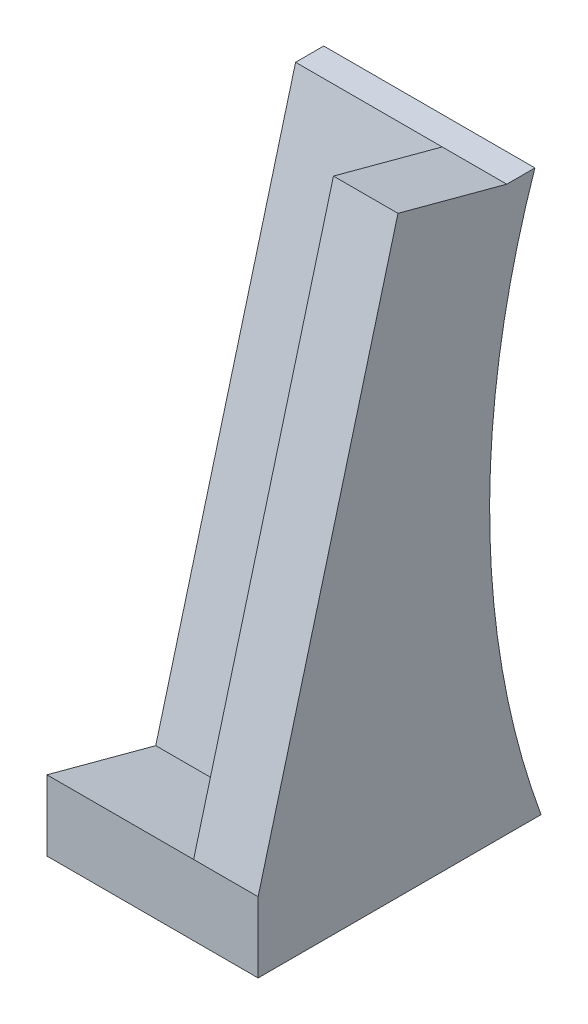
ISO-10303-21;
HEADER;
FILE_DESCRIPTION(('STEP AP214'),'2;1');
FILE_NAME('part.step','',(''),(''),'','','');
FILE_SCHEMA(('AUTOMOTIVE_DESIGN { 1 0 10303 214 1 1 1 1 }'));
ENDSEC;
DATA;
#1=APPLICATION_CONTEXT('core data for automotive mechanical design processes');
#2=APPLICATION_PROTOCOL_DEFINITION('international standard','automotive_design',2000,#1);
#3=PRODUCT_CONTEXT('',#1,'mechanical');
#4=PRODUCT('Part','Part','',(#3));
#5=PRODUCT_RELATED_PRODUCT_CATEGORY('part','',(#4));
#6=PRODUCT_DEFINITION_FORMATION('','',#4);
#7=PRODUCT_DEFINITION_CONTEXT('part definition',#1,'design');
#8=PRODUCT_DEFINITION('design','',#6,#7);
#9=PRODUCT_DEFINITION_SHAPE('','',#8);
#10=(LENGTH_UNIT() NAMED_UNIT(*) SI_UNIT(.MILLI.,.METRE.));
#11=(NAMED_UNIT(*) PLANE_ANGLE_UNIT() SI_UNIT($,.RADIAN.));
#12=(NAMED_UNIT(*) SI_UNIT($,.STERADIAN.) SOLID_ANGLE_UNIT());
#13=UNCERTAINTY_MEASURE_WITH_UNIT(LENGTH_MEASURE(1.E-05),#10,'distance_accuracy_value','');
#14=(GEOMETRIC_REPRESENTATION_CONTEXT(3) GLOBAL_UNCERTAINTY_ASSIGNED_CONTEXT((#13)) GLOBAL_UNIT_ASSIGNED_CONTEXT((#10,
#11,#12)) REPRESENTATION_CONTEXT('',''));
#15=CARTESIAN_POINT('',(0.,0.,0.));
#16=DIRECTION('',(0.,0.,1.));
#17=DIRECTION('',(1.,0.,0.));
#18=AXIS2_PLACEMENT_3D('',#15,#16,#17);
#19=CARTESIAN_POINT('',(38.1,7.44079700351684,-19.6276127901939));
#20=DIRECTION('',(0.,-0.258819045102514,-0.96592582628907));
#21=DIRECTION('',(0.,0.96592582628907,-0.258819045102514));
#22=AXIS2_PLACEMENT_3D('',#19,#20,#21);
#23=PLANE('',#22);
#24=DIRECTION('',(0.,-0.96592582628907,0.258819045102514));
#25=VECTOR('',#24,1.);
#26=CARTESIAN_POINT('',(26.4595011753954,101.6,-44.857495193059));
#27=LINE('',#26,#25);
#28=CARTESIAN_POINT('',(26.4595011753954,101.6,-44.857495193059));
#29=VERTEX_POINT('',#28);
#30=CARTESIAN_POINT('',(26.4595011753954,7.44079700351687,-19.6276127901939));
#31=VERTEX_POINT('',#30);
#32=EDGE_CURVE('E119',#29,#31,#27,.T.);
#33=ORIENTED_EDGE('',*,*,#32,.F.);
#34=DIRECTION('',(-1.,0.,0.));
#35=VECTOR('',#34,1.);
#36=CARTESIAN_POINT('',(38.1,101.6,-44.857495193059));
#37=LINE('',#36,#35);
#38=CARTESIAN_POINT('',(0.,101.6,-44.857495193059));
#39=VERTEX_POINT('',#38);
#40=EDGE_CURVE('E136',#29,#39,#37,.T.);
#41=ORIENTED_EDGE('',*,*,#40,.T.);
#42=DIRECTION('',(0.,-0.96592582628907,0.258819045102514));
#43=VECTOR('',#42,1.);
#44=CARTESIAN_POINT('',(0.,7.44079700351684,-19.6276127901939));
#45=LINE('',#44,#43);
#46=CARTESIAN_POINT('',(0.,7.44079700351684,-19.6276127901939));
#47=VERTEX_POINT('',#46);
#48=EDGE_CURVE('E158',#39,#47,#45,.T.);
#49=ORIENTED_EDGE('',*,*,#48,.T.);
#50=DIRECTION('',(-1.,0.,0.));
#51=VECTOR('',#50,1.);
#52=CARTESIAN_POINT('',(38.1,7.44079700351684,-19.6276127901939));
#53=LINE('',#52,#51);
#54=EDGE_CURVE('E73',#31,#47,#53,.T.);
#55=ORIENTED_EDGE('',*,*,#54,.F.);
#56=EDGE_LOOP('',(#33,#41,#49,#55));
#57=FACE_BOUND('',#56,.T.);
#58=ADVANCED_FACE('F32',(#57),#23,.F.);
#59=CARTESIAN_POINT('',(38.1,12.7,0.));
#60=DIRECTION('',(0.,-0.965925826289069,0.258819045102518));
#61=DIRECTION('',(0.,-0.258819045102518,-0.965925826289069));
#62=AXIS2_PLACEMENT_3D('',#59,#60,#61);
#63=PLANE('',#62);
#64=DIRECTION('',(0.,-0.258819045102514,-0.96592582628907));
#65=VECTOR('',#64,1.);
#66=CARTESIAN_POINT('',(26.4595011753954,12.7,0.));
#67=LINE('',#66,#65);
#68=CARTESIAN_POINT('',(26.4595011753954,12.7,0.));
#69=VERTEX_POINT('',#68);
#70=EDGE_CURVE('E121',#69,#31,#67,.T.);
#71=ORIENTED_EDGE('',*,*,#70,.T.);
#72=ORIENTED_EDGE('',*,*,#54,.T.);
#73=DIRECTION('',(0.,0.258819045102518,0.965925826289069));
#74=VECTOR('',#73,1.);
#75=CARTESIAN_POINT('',(0.,12.7,0.));
#76=LINE('',#75,#74);
#77=CARTESIAN_POINT('',(0.,12.7,0.));
#78=VERTEX_POINT('',#77);
#79=EDGE_CURVE('E129',#47,#78,#76,.T.);
#80=ORIENTED_EDGE('',*,*,#79,.T.);
#81=DIRECTION('',(-1.,0.,0.));
#82=VECTOR('',#81,1.);
#83=CARTESIAN_POINT('',(38.1,12.7,0.));
#84=LINE('',#83,#82);
#85=EDGE_CURVE('E80',#69,#78,#84,.T.);
#86=ORIENTED_EDGE('',*,*,#85,.F.);
#87=EDGE_LOOP('',(#71,#72,#80,#86));
#88=FACE_BOUND('',#87,.T.);
#89=ADVANCED_FACE('F127',(#88),#63,.F.);
#90=CARTESIAN_POINT('',(38.1,12.7,0.));
#91=DIRECTION('',(0.,0.,-1.));
#92=DIRECTION('',(0.,1.,0.));
#93=AXIS2_PLACEMENT_3D('',#90,#91,#92);
#94=PLANE('',#93);
#95=DIRECTION('',(0.,-1.,0.));
#96=VECTOR('',#95,1.);
#97=CARTESIAN_POINT('',(0.,12.7,0.));
#98=LINE('',#97,#96);
#99=CARTESIAN_POINT('',(0.,0.,0.));
#100=VERTEX_POINT('',#99);
#101=EDGE_CURVE('E124',#78,#100,#98,.T.);
#102=ORIENTED_EDGE('',*,*,#101,.T.);
#103=DIRECTION('',(-1.,0.,0.));
#104=VECTOR('',#103,1.);
#105=CARTESIAN_POINT('',(38.1,0.,0.));
#106=LINE('',#105,#104);
#107=CARTESIAN_POINT('',(38.1,0.,0.));
#108=VERTEX_POINT('',#107);
#109=EDGE_CURVE('E11',#108,#100,#106,.T.);
#110=ORIENTED_EDGE('',*,*,#109,.F.);
#111=DIRECTION('',(0.,-1.,0.));
#112=VECTOR('',#111,1.);
#113=CARTESIAN_POINT('',(38.1,12.7,0.));
#114=LINE('',#113,#112);
#115=CARTESIAN_POINT('',(38.1,12.7,0.));
#116=VERTEX_POINT('',#115);
#117=EDGE_CURVE('E135',#116,#108,#114,.T.);
#118=ORIENTED_EDGE('',*,*,#117,.F.);
#119=EDGE_CURVE('E111',#116,#69,#84,.T.);
#120=ORIENTED_EDGE('',*,*,#119,.T.);
#121=ORIENTED_EDGE('',*,*,#85,.T.);
#122=EDGE_LOOP('',(#102,#110,#118,#120,#121));
#123=FACE_BOUND('',#122,.T.);
#124=ADVANCED_FACE('F34',(#123),#94,.F.);
#125=CARTESIAN_POINT('',(38.1,0.,0.));
#126=DIRECTION('',(0.,1.,0.));
#127=DIRECTION('',(0.,0.,1.));
#128=AXIS2_PLACEMENT_3D('',#125,#126,#127);
#129=PLANE('',#128);
#130=DIRECTION('',(0.,0.,-1.));
#131=VECTOR('',#130,1.);
#132=CARTESIAN_POINT('',(0.,0.,0.));
#133=LINE('',#132,#131);
#134=CARTESIAN_POINT('',(0.,0.,-51.0442339810043));
#135=VERTEX_POINT('',#134);
#136=EDGE_CURVE('E153',#100,#135,#133,.T.);
#137=ORIENTED_EDGE('',*,*,#136,.T.);
#138=DIRECTION('',(-1.,0.,0.));
#139=VECTOR('',#138,1.);
#140=CARTESIAN_POINT('',(38.1,0.,-51.0442339810043));
#141=LINE('',#140,#139);
#142=CARTESIAN_POINT('',(38.1,0.,-51.0442339810043));
#143=VERTEX_POINT('',#142);
#144=EDGE_CURVE('E41',#143,#135,#141,.T.);
#145=ORIENTED_EDGE('',*,*,#144,.F.);
#146=DIRECTION('',(0.,0.,-1.));
#147=VECTOR('',#146,1.);
#148=CARTESIAN_POINT('',(38.1,0.,0.));
#149=LINE('',#148,#147);
#150=EDGE_CURVE('E84',#108,#143,#149,.T.);
#151=ORIENTED_EDGE('',*,*,#150,.F.);
#152=ORIENTED_EDGE('',*,*,#109,.T.);
#153=EDGE_LOOP('',(#137,#145,#151,#152));
#154=FACE_BOUND('',#153,.T.);
#155=ADVANCED_FACE('F168',(#154),#129,.F.);
#156=CARTESIAN_POINT('',(38.1,52.3650605442912,-194.165373000342));
#157=DIRECTION('',(-1.,0.,0.));
#158=DIRECTION('',(0.,0.,1.));
#159=AXIS2_PLACEMENT_3D('',#156,#157,#158);
#160=CYLINDRICAL_SURFACE('',#159,152.4);
#161=CARTESIAN_POINT('',(0.,52.3650605442912,-194.165373000342));
#162=DIRECTION('',(-1.,0.,0.));
#163=DIRECTION('',(0.,0.,-1.));
#164=AXIS2_PLACEMENT_3D('',#161,#162,#163);
#165=CIRCLE('',#164,152.4);
#166=CARTESIAN_POINT('',(0.,101.6,-49.937495193059));
#167=VERTEX_POINT('',#166);
#168=EDGE_CURVE('E149',#135,#167,#165,.T.);
#169=ORIENTED_EDGE('',*,*,#168,.T.);
#170=DIRECTION('',(-1.,0.,0.));
#171=VECTOR('',#170,1.);
#172=CARTESIAN_POINT('',(38.1,101.6,-49.937495193059));
#173=LINE('',#172,#171);
#174=CARTESIAN_POINT('',(38.1,101.6,-49.937495193059));
#175=VERTEX_POINT('',#174);
#176=EDGE_CURVE('E143',#175,#167,#173,.T.);
#177=ORIENTED_EDGE('',*,*,#176,.F.);
#178=CARTESIAN_POINT('',(38.1,52.3650605442912,-194.165373000342));
#179=DIRECTION('',(-1.,0.,0.));
#180=DIRECTION('',(0.,0.,-1.));
#181=AXIS2_PLACEMENT_3D('',#178,#179,#180);
#182=CIRCLE('',#181,152.4);
#183=EDGE_CURVE('E49',#143,#175,#182,.T.);
#184=ORIENTED_EDGE('',*,*,#183,.F.);
#185=ORIENTED_EDGE('',*,*,#144,.T.);
#186=EDGE_LOOP('',(#169,#177,#184,#185));
#187=FACE_BOUND('',#186,.T.);
#188=ADVANCED_FACE('F148',(#187),#160,.F.);
#189=CARTESIAN_POINT('',(38.1,101.6,-44.857495193059));
#190=DIRECTION('',(0.,-1.,0.));
#191=DIRECTION('',(0.,0.,-1.));
#192=AXIS2_PLACEMENT_3D('',#189,#190,#191);
#193=PLANE('',#192);
#194=DIRECTION('',(0.,0.,1.));
#195=VECTOR('',#194,1.);
#196=CARTESIAN_POINT('',(0.,101.6,-44.857495193059));
#197=LINE('',#196,#195);
#198=EDGE_CURVE('E156',#167,#39,#197,.T.);
#199=ORIENTED_EDGE('',*,*,#198,.T.);
#200=ORIENTED_EDGE('',*,*,#40,.F.);
#201=CARTESIAN_POINT('',(38.1,101.6,-44.857495193059));
#202=VERTEX_POINT('',#201);
#203=EDGE_CURVE('E141',#202,#29,#37,.T.);
#204=ORIENTED_EDGE('',*,*,#203,.F.);
#205=DIRECTION('',(0.,0.,1.));
#206=VECTOR('',#205,1.);
#207=CARTESIAN_POINT('',(38.1,101.6,-44.857495193059));
#208=LINE('',#207,#206);
#209=EDGE_CURVE('E131',#175,#202,#208,.T.);
#210=ORIENTED_EDGE('',*,*,#209,.F.);
#211=ORIENTED_EDGE('',*,*,#176,.T.);
#212=EDGE_LOOP('',(#199,#200,#204,#210,#211));
#213=FACE_BOUND('',#212,.T.);
#214=ADVANCED_FACE('F174',(#213),#193,.F.);
#215=CARTESIAN_POINT('',(38.1,52.3650605442912,-194.165373000342));
#216=DIRECTION('',(1.,0.,0.));
#217=DIRECTION('',(0.,0.,-1.));
#218=AXIS2_PLACEMENT_3D('',#215,#216,#217);
#219=PLANE('',#218);
#220=DIRECTION('',(0.,0.96592582628907,-0.258819045102514));
#221=VECTOR('',#220,1.);
#222=CARTESIAN_POINT('',(38.1,106.859202996483,-25.2298824028651));
#223=LINE('',#222,#221);
#224=CARTESIAN_POINT('',(38.1,106.859202996483,-25.2298824028651));
#225=VERTEX_POINT('',#224);
#226=EDGE_CURVE('E118',#116,#225,#223,.T.);
#227=ORIENTED_EDGE('',*,*,#226,.F.);
#228=ORIENTED_EDGE('',*,*,#117,.T.);
#229=ORIENTED_EDGE('',*,*,#150,.T.);
#230=ORIENTED_EDGE('',*,*,#183,.T.);
#231=ORIENTED_EDGE('',*,*,#209,.T.);
#232=DIRECTION('',(0.,-0.258819045102514,-0.96592582628907));
#233=VECTOR('',#232,1.);
#234=CARTESIAN_POINT('',(38.1,106.859202996483,-25.2298824028651));
#235=LINE('',#234,#233);
#236=EDGE_CURVE('E125',#225,#202,#235,.T.);
#237=ORIENTED_EDGE('',*,*,#236,.F.);
#238=EDGE_LOOP('',(#227,#228,#229,#230,#231,#237));
#239=FACE_BOUND('',#238,.T.);
#240=ADVANCED_FACE('F185',(#239),#219,.T.);
#241=CARTESIAN_POINT('',(0.,52.3650605442912,-194.165373000342));
#242=DIRECTION('',(1.,0.,0.));
#243=DIRECTION('',(0.,0.,-1.));
#244=AXIS2_PLACEMENT_3D('',#241,#242,#243);
#245=PLANE('',#244);
#246=ORIENTED_EDGE('',*,*,#101,.F.);
#247=ORIENTED_EDGE('',*,*,#79,.F.);
#248=ORIENTED_EDGE('',*,*,#48,.F.);
#249=ORIENTED_EDGE('',*,*,#198,.F.);
#250=ORIENTED_EDGE('',*,*,#168,.F.);
#251=ORIENTED_EDGE('',*,*,#136,.F.);
#252=EDGE_LOOP('',(#246,#247,#248,#249,#250,#251));
#253=FACE_BOUND('',#252,.T.);
#254=ADVANCED_FACE('F152',(#253),#245,.F.);
#255=CARTESIAN_POINT('',(26.4595011753954,106.859202996483,-25.2298824028651));
#256=DIRECTION('',(1.,0.,0.));
#257=DIRECTION('',(0.,1.,0.));
#258=AXIS2_PLACEMENT_3D('',#255,#256,#257);
#259=PLANE('',#258);
#260=ORIENTED_EDGE('',*,*,#32,.T.);
#261=ORIENTED_EDGE('',*,*,#70,.F.);
#262=DIRECTION('',(0.,-0.96592582628907,0.258819045102514));
#263=VECTOR('',#262,1.);
#264=CARTESIAN_POINT('',(26.4595011753954,106.859202996483,-25.2298824028651));
#265=LINE('',#264,#263);
#266=CARTESIAN_POINT('',(26.4595011753954,106.859202996483,-25.2298824028651));
#267=VERTEX_POINT('',#266);
#268=EDGE_CURVE('E108',#267,#69,#265,.T.);
#269=ORIENTED_EDGE('',*,*,#268,.F.);
#270=DIRECTION('',(0.,-0.258819045102514,-0.96592582628907));
#271=VECTOR('',#270,1.);
#272=CARTESIAN_POINT('',(26.4595011753954,106.859202996483,-25.2298824028651));
#273=LINE('',#272,#271);
#274=EDGE_CURVE('E196',#267,#29,#273,.T.);
#275=ORIENTED_EDGE('',*,*,#274,.T.);
#276=EDGE_LOOP('',(#260,#261,#269,#275));
#277=FACE_BOUND('',#276,.T.);
#278=ADVANCED_FACE('F122',(#277),#259,.F.);
#279=CARTESIAN_POINT('',(26.4595011753954,106.859202996483,-25.2298824028651));
#280=DIRECTION('',(0.,-0.96592582628907,0.258819045102514));
#281=DIRECTION('',(0.,-0.258819045102514,-0.96592582628907));
#282=AXIS2_PLACEMENT_3D('',#279,#280,#281);
#283=PLANE('',#282);
#284=ORIENTED_EDGE('',*,*,#203,.T.);
#285=ORIENTED_EDGE('',*,*,#274,.F.);
#286=DIRECTION('',(-1.,0.,0.));
#287=VECTOR('',#286,1.);
#288=CARTESIAN_POINT('',(26.4595011753954,106.859202996483,-25.2298824028651));
#289=LINE('',#288,#287);
#290=EDGE_CURVE('E114',#225,#267,#289,.T.);
#291=ORIENTED_EDGE('',*,*,#290,.F.);
#292=ORIENTED_EDGE('',*,*,#236,.T.);
#293=EDGE_LOOP('',(#284,#285,#291,#292));
#294=FACE_BOUND('',#293,.T.);
#295=ADVANCED_FACE('F197',(#294),#283,.F.);
#296=CARTESIAN_POINT('',(0.,0.85073868596877,3.17499999999991));
#297=DIRECTION('',(0.,0.258819045102514,0.96592582628907));
#298=DIRECTION('',(0.,-0.96592582628907,0.258819045102514));
#299=AXIS2_PLACEMENT_3D('',#296,#297,#298);
#300=PLANE('',#299);
#301=ORIENTED_EDGE('',*,*,#268,.T.);
#302=ORIENTED_EDGE('',*,*,#119,.F.);
#303=ORIENTED_EDGE('',*,*,#226,.T.);
#304=ORIENTED_EDGE('',*,*,#290,.T.);
#305=EDGE_LOOP('',(#301,#302,#303,#304));
#306=FACE_BOUND('',#305,.T.);
#307=ADVANCED_FACE('F110',(#306),#300,.T.);
#308=CLOSED_SHELL('',(#58,#89,#124,#155,#188,#214,#240,#254,#278,#295,#307));
#309=MANIFOLD_SOLID_BREP('B2',#308);
#310=ADVANCED_BREP_SHAPE_REPRESENTATION('',(#18,#309),#14);
#311=SHAPE_DEFINITION_REPRESENTATION(#9,#310);
ENDSEC;
END-ISO-10303-21;
